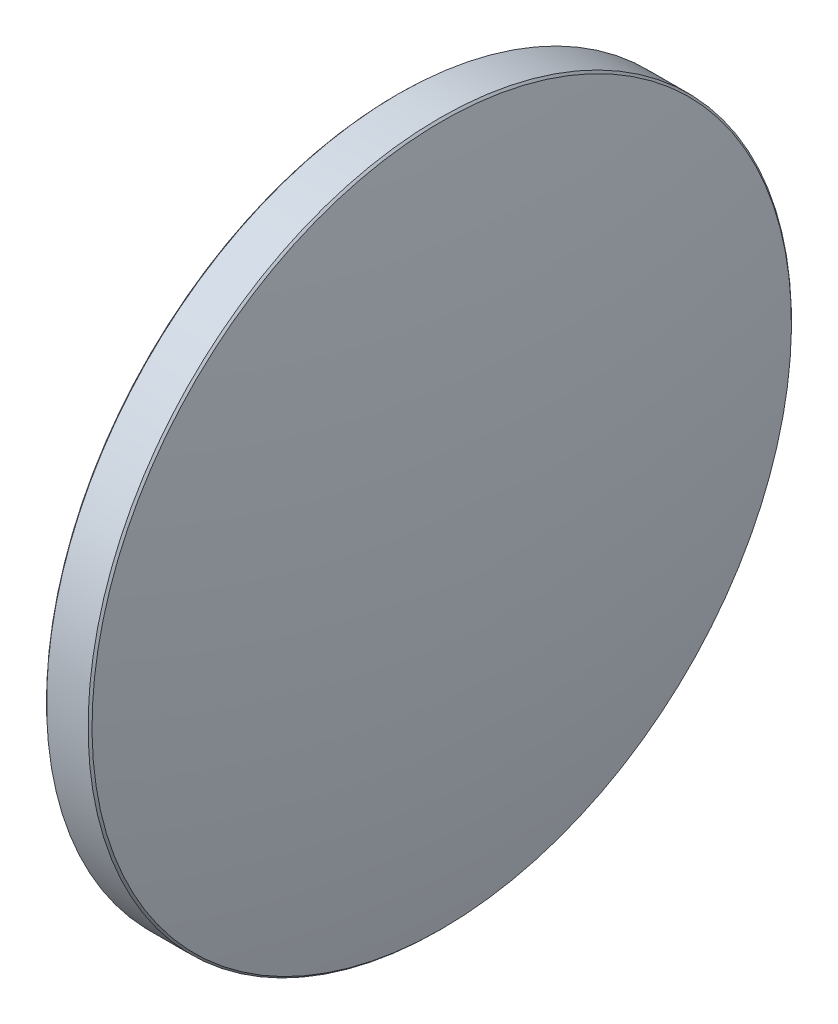
ISO-10303-21;
HEADER;
FILE_DESCRIPTION(('STEP AP214'),'2;1');
FILE_NAME('part.step','',(''),(''),'','','');
FILE_SCHEMA(('AUTOMOTIVE_DESIGN { 1 0 10303 214 1 1 1 1 }'));
ENDSEC;
DATA;
#1=APPLICATION_CONTEXT('core data for automotive mechanical design processes');
#2=APPLICATION_PROTOCOL_DEFINITION('international standard','automotive_design',2000,#1);
#3=PRODUCT_CONTEXT('',#1,'mechanical');
#4=PRODUCT('Part','Part','',(#3));
#5=PRODUCT_RELATED_PRODUCT_CATEGORY('part','',(#4));
#6=PRODUCT_DEFINITION_FORMATION('','',#4);
#7=PRODUCT_DEFINITION_CONTEXT('part definition',#1,'design');
#8=PRODUCT_DEFINITION('design','',#6,#7);
#9=PRODUCT_DEFINITION_SHAPE('','',#8);
#10=(LENGTH_UNIT() NAMED_UNIT(*) SI_UNIT(.MILLI.,.METRE.));
#11=(NAMED_UNIT(*) PLANE_ANGLE_UNIT() SI_UNIT($,.RADIAN.));
#12=(NAMED_UNIT(*) SI_UNIT($,.STERADIAN.) SOLID_ANGLE_UNIT());
#13=UNCERTAINTY_MEASURE_WITH_UNIT(LENGTH_MEASURE(1.E-05),#10,'distance_accuracy_value','');
#14=(GEOMETRIC_REPRESENTATION_CONTEXT(3) GLOBAL_UNCERTAINTY_ASSIGNED_CONTEXT((#13)) GLOBAL_UNIT_ASSIGNED_CONTEXT((#10,
#11,#12)) REPRESENTATION_CONTEXT('',''));
#15=CARTESIAN_POINT('',(0.,0.,0.));
#16=DIRECTION('',(0.,0.,1.));
#17=DIRECTION('',(1.,0.,0.));
#18=AXIS2_PLACEMENT_3D('',#15,#16,#17);
#19=CARTESIAN_POINT('',(132.899093808692,-0.497928830896851,0.));
#20=DIRECTION('',(0.,0.,-1.));
#21=DIRECTION('',(0.,-1.,0.));
#22=AXIS2_PLACEMENT_3D('',#19,#20,#21);
#23=CIRCLE('',#22,136.8);
#24=TRIMMED_CURVE('',#23,(PARAMETER_VALUE(-1.57443616546712)),
(PARAMETER_VALUE(1.57443616546712)),.T.,.PARAMETER.);
#25=CARTESIAN_POINT('',(132.899093808692,0.,0.));
#26=DIRECTION('',(-1.,0.,0.));
#27=AXIS1_PLACEMENT('',#25,#26);
#28=SURFACE_OF_REVOLUTION('',#24,#27);
#29=CARTESIAN_POINT('',(-3.9,0.,0.));
#30=VERTEX_POINT('',#29);
#31=VERTEX_LOOP('',#30);
#32=FACE_BOUND('',#31,.T.);
#33=CARTESIAN_POINT('',(-1.64142135623734,0.,0.));
#34=DIRECTION('',(-1.,0.,0.));
#35=DIRECTION('',(0.,-1.,0.));
#36=AXIS2_PLACEMENT_3D('',#33,#34,#35);
#37=CIRCLE('',#36,25.2585786437627);
#38=CARTESIAN_POINT('',(-1.64142135623733,-25.2585786437627,0.));
#39=VERTEX_POINT('',#38);
#40=EDGE_CURVE('E10',#39,#39,#37,.T.);
#41=ORIENTED_EDGE('',*,*,#40,.T.);
#42=EDGE_LOOP('',(#41));
#43=FACE_BOUND('',#42,.T.);
#44=ADVANCED_FACE('F15',(#32,#43),#28,.T.);
#45=CARTESIAN_POINT('',(-1.50000000000002,0.,0.));
#46=DIRECTION('',(1.,0.,0.));
#47=DIRECTION('',(0.,1.,0.));
#48=AXIS2_PLACEMENT_3D('',#45,#46,#47);
#49=CONICAL_SURFACE('',#48,25.4,0.785398163397425);
#50=ORIENTED_EDGE('',*,*,#40,.F.);
#51=EDGE_LOOP('',(#50));
#52=FACE_BOUND('',#51,.T.);
#53=CARTESIAN_POINT('',(-1.50000000000002,0.,0.));
#54=DIRECTION('',(-1.,0.,0.));
#55=DIRECTION('',(0.,-1.,0.));
#56=AXIS2_PLACEMENT_3D('',#53,#54,#55);
#57=CIRCLE('',#56,25.4);
#58=CARTESIAN_POINT('',(-1.50000000000002,-25.4,0.));
#59=VERTEX_POINT('',#58);
#60=EDGE_CURVE('E22',#59,#59,#57,.T.);
#61=ORIENTED_EDGE('',*,*,#60,.T.);
#62=EDGE_LOOP('',(#61));
#63=FACE_BOUND('',#62,.T.);
#64=ADVANCED_FACE('F30',(#52,#63),#49,.T.);
#65=CARTESIAN_POINT('',(-3.9,0.,0.));
#66=DIRECTION('',(-1.,0.,0.));
#67=DIRECTION('',(0.,-1.,0.));
#68=AXIS2_PLACEMENT_3D('',#65,#66,#67);
#69=CYLINDRICAL_SURFACE('',#68,25.4);
#70=ORIENTED_EDGE('',*,*,#60,.F.);
#71=EDGE_LOOP('',(#70));
#72=FACE_BOUND('',#71,.T.);
#73=CARTESIAN_POINT('',(1.50000000000003,0.,0.));
#74=DIRECTION('',(-1.,0.,0.));
#75=DIRECTION('',(0.,-1.,0.));
#76=AXIS2_PLACEMENT_3D('',#73,#74,#75);
#77=CIRCLE('',#76,25.4);
#78=CARTESIAN_POINT('',(1.50000000000004,-25.4,0.));
#79=VERTEX_POINT('',#78);
#80=EDGE_CURVE('E39',#79,#79,#77,.T.);
#81=ORIENTED_EDGE('',*,*,#80,.T.);
#82=EDGE_LOOP('',(#81));
#83=FACE_BOUND('',#82,.T.);
#84=ADVANCED_FACE('F35',(#72,#83),#69,.T.);
#85=CARTESIAN_POINT('',(1.64142135623733,0.,0.));
#86=DIRECTION('',(-1.,0.,0.));
#87=DIRECTION('',(0.,-1.,0.));
#88=AXIS2_PLACEMENT_3D('',#85,#86,#87);
#89=CONICAL_SURFACE('',#88,25.2585786437627,0.78539816339751);
#90=ORIENTED_EDGE('',*,*,#80,.F.);
#91=EDGE_LOOP('',(#90));
#92=FACE_BOUND('',#91,.T.);
#93=CARTESIAN_POINT('',(1.64142135623733,0.,0.));
#94=DIRECTION('',(-1.,0.,0.));
#95=DIRECTION('',(0.,-1.,0.));
#96=AXIS2_PLACEMENT_3D('',#93,#94,#95);
#97=CIRCLE('',#96,25.2585786437627);
#98=CARTESIAN_POINT('',(1.64142135623733,-25.2585786437627,0.));
#99=VERTEX_POINT('',#98);
#100=EDGE_CURVE('E41',#99,#99,#97,.T.);
#101=ORIENTED_EDGE('',*,*,#100,.T.);
#102=EDGE_LOOP('',(#101));
#103=FACE_BOUND('',#102,.T.);
#104=ADVANCED_FACE('F47',(#92,#103),#89,.T.);
#105=CARTESIAN_POINT('',(-132.899093808692,-0.497928830896942,0.));
#106=DIRECTION('',(0.,0.,-1.));
#107=DIRECTION('',(0.,-1.,0.));
#108=AXIS2_PLACEMENT_3D('',#105,#106,#107);
#109=CIRCLE('',#108,136.8);
#110=TRIMMED_CURVE('',#109,(PARAMETER_VALUE(-1.57443616546712)),
(PARAMETER_VALUE(1.57443616546712)),.T.,.PARAMETER.);
#111=CARTESIAN_POINT('',(-132.899093808692,0.,0.));
#112=DIRECTION('',(-1.,0.,0.));
#113=AXIS1_PLACEMENT('',#111,#112);
#114=SURFACE_OF_REVOLUTION('',#110,#113);
#115=ORIENTED_EDGE('',*,*,#100,.F.);
#116=EDGE_LOOP('',(#115));
#117=FACE_BOUND('',#116,.T.);
#118=CARTESIAN_POINT('',(3.9,0.,0.));
#119=VERTEX_POINT('',#118);
#120=VERTEX_LOOP('',#119);
#121=FACE_BOUND('',#120,.T.);
#122=ADVANCED_FACE('F49',(#117,#121),#114,.T.);
#123=CLOSED_SHELL('',(#44,#64,#84,#104,#122));
#124=MANIFOLD_SOLID_BREP('B1',#123);
#125=ADVANCED_BREP_SHAPE_REPRESENTATION('',(#18,#124),#14);
#126=SHAPE_DEFINITION_REPRESENTATION(#9,#125);
ENDSEC;
END-ISO-10303-21;
